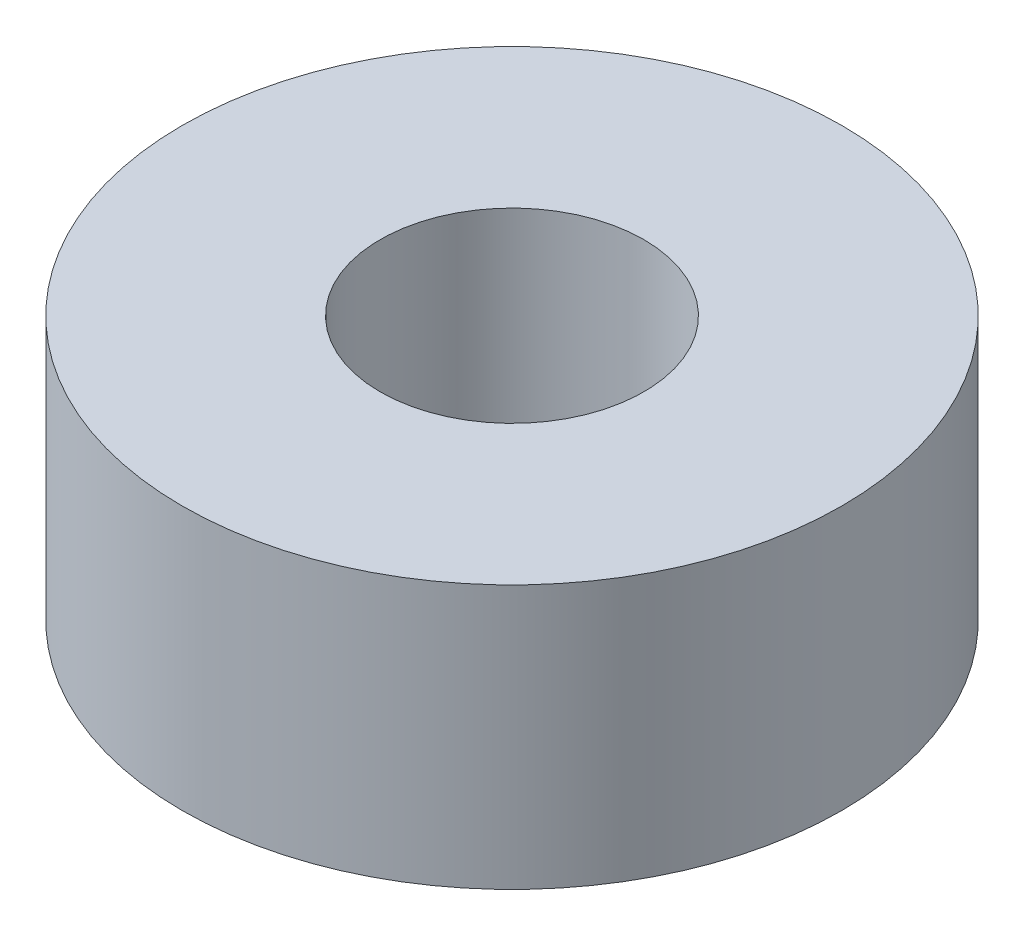
ISO-10303-21;
HEADER;
FILE_DESCRIPTION(('STEP AP214'),'2;1');
FILE_NAME('part.step','',(''),(''),'','','');
FILE_SCHEMA(('AUTOMOTIVE_DESIGN { 1 0 10303 214 1 1 1 1 }'));
ENDSEC;
DATA;
#1=APPLICATION_CONTEXT('core data for automotive mechanical design processes');
#2=APPLICATION_PROTOCOL_DEFINITION('international standard','automotive_design',2000,#1);
#3=PRODUCT_CONTEXT('',#1,'mechanical');
#4=PRODUCT('Part','Part','',(#3));
#5=PRODUCT_RELATED_PRODUCT_CATEGORY('part','',(#4));
#6=PRODUCT_DEFINITION_FORMATION('','',#4);
#7=PRODUCT_DEFINITION_CONTEXT('part definition',#1,'design');
#8=PRODUCT_DEFINITION('design','',#6,#7);
#9=PRODUCT_DEFINITION_SHAPE('','',#8);
#10=(LENGTH_UNIT() NAMED_UNIT(*) SI_UNIT(.MILLI.,.METRE.));
#11=(NAMED_UNIT(*) PLANE_ANGLE_UNIT() SI_UNIT($,.RADIAN.));
#12=(NAMED_UNIT(*) SI_UNIT($,.STERADIAN.) SOLID_ANGLE_UNIT());
#13=UNCERTAINTY_MEASURE_WITH_UNIT(LENGTH_MEASURE(1.E-05),#10,'distance_accuracy_value','');
#14=(GEOMETRIC_REPRESENTATION_CONTEXT(3) GLOBAL_UNCERTAINTY_ASSIGNED_CONTEXT((#13)) GLOBAL_UNIT_ASSIGNED_CONTEXT((#10,
#11,#12)) REPRESENTATION_CONTEXT('',''));
#15=CARTESIAN_POINT('',(0.,0.,0.));
#16=DIRECTION('',(0.,0.,1.));
#17=DIRECTION('',(1.,0.,0.));
#18=AXIS2_PLACEMENT_3D('',#15,#16,#17);
#19=CARTESIAN_POINT('',(0.,10.,0.));
#20=DIRECTION('',(0.,1.,0.));
#21=DIRECTION('',(0.,0.,1.));
#22=AXIS2_PLACEMENT_3D('',#19,#20,#21);
#23=PLANE('',#22);
#24=CARTESIAN_POINT('',(0.,10.,0.));
#25=DIRECTION('',(0.,1.,0.));
#26=DIRECTION('',(0.,0.,1.));
#27=AXIS2_PLACEMENT_3D('',#24,#25,#26);
#28=CIRCLE('',#27,12.5);
#29=CARTESIAN_POINT('',(0.,10.,12.5));
#30=VERTEX_POINT('',#29);
#31=EDGE_CURVE('E10',#30,#30,#28,.T.);
#32=ORIENTED_EDGE('',*,*,#31,.T.);
#33=EDGE_LOOP('',(#32));
#34=FACE_BOUND('',#33,.T.);
#35=CARTESIAN_POINT('',(0.,10.,0.));
#36=DIRECTION('',(0.,1.,0.));
#37=DIRECTION('',(0.,0.,1.));
#38=AXIS2_PLACEMENT_3D('',#35,#36,#37);
#39=CIRCLE('',#38,5.);
#40=CARTESIAN_POINT('',(0.,10.,5.));
#41=VERTEX_POINT('',#40);
#42=EDGE_CURVE('E46',#41,#41,#39,.T.);
#43=ORIENTED_EDGE('',*,*,#42,.F.);
#44=EDGE_LOOP('',(#43));
#45=FACE_BOUND('',#44,.T.);
#46=ADVANCED_FACE('F35',(#34,#45),#23,.T.);
#47=CARTESIAN_POINT('',(0.,0.,0.));
#48=DIRECTION('',(0.,1.,0.));
#49=DIRECTION('',(0.,0.,1.));
#50=AXIS2_PLACEMENT_3D('',#47,#48,#49);
#51=PLANE('',#50);
#52=CARTESIAN_POINT('',(0.,0.,0.));
#53=DIRECTION('',(0.,1.,0.));
#54=DIRECTION('',(0.,0.,1.));
#55=AXIS2_PLACEMENT_3D('',#52,#53,#54);
#56=CIRCLE('',#55,12.5);
#57=CARTESIAN_POINT('',(0.,0.,12.5));
#58=VERTEX_POINT('',#57);
#59=EDGE_CURVE('E39',#58,#58,#56,.T.);
#60=ORIENTED_EDGE('',*,*,#59,.F.);
#61=EDGE_LOOP('',(#60));
#62=FACE_BOUND('',#61,.T.);
#63=CARTESIAN_POINT('',(0.,0.,0.));
#64=DIRECTION('',(0.,1.,0.));
#65=DIRECTION('',(0.,0.,1.));
#66=AXIS2_PLACEMENT_3D('',#63,#64,#65);
#67=CIRCLE('',#66,5.);
#68=CARTESIAN_POINT('',(0.,0.,5.));
#69=VERTEX_POINT('',#68);
#70=EDGE_CURVE('E48',#69,#69,#67,.T.);
#71=ORIENTED_EDGE('',*,*,#70,.T.);
#72=EDGE_LOOP('',(#71));
#73=FACE_BOUND('',#72,.T.);
#74=ADVANCED_FACE('F58',(#62,#73),#51,.F.);
#75=CARTESIAN_POINT('',(0.,10.,0.));
#76=DIRECTION('',(0.,-1.,0.));
#77=DIRECTION('',(0.,0.,-1.));
#78=AXIS2_PLACEMENT_3D('',#75,#76,#77);
#79=CYLINDRICAL_SURFACE('',#78,12.5);
#80=ORIENTED_EDGE('',*,*,#31,.F.);
#81=EDGE_LOOP('',(#80));
#82=FACE_BOUND('',#81,.T.);
#83=ORIENTED_EDGE('',*,*,#59,.T.);
#84=EDGE_LOOP('',(#83));
#85=FACE_BOUND('',#84,.T.);
#86=ADVANCED_FACE('F37',(#82,#85),#79,.T.);
#87=CARTESIAN_POINT('',(0.,10.,0.));
#88=DIRECTION('',(0.,-1.,0.));
#89=DIRECTION('',(0.,0.,-1.));
#90=AXIS2_PLACEMENT_3D('',#87,#88,#89);
#91=CYLINDRICAL_SURFACE('',#90,5.);
#92=ORIENTED_EDGE('',*,*,#42,.T.);
#93=EDGE_LOOP('',(#92));
#94=FACE_BOUND('',#93,.T.);
#95=ORIENTED_EDGE('',*,*,#70,.F.);
#96=EDGE_LOOP('',(#95));
#97=FACE_BOUND('',#96,.T.);
#98=ADVANCED_FACE('F54',(#94,#97),#91,.F.);
#99=CLOSED_SHELL('',(#46,#74,#86,#98));
#100=MANIFOLD_SOLID_BREP('B2',#99);
#101=ADVANCED_BREP_SHAPE_REPRESENTATION('',(#18,#100),#14);
#102=SHAPE_DEFINITION_REPRESENTATION(#9,#101);
ENDSEC;
END-ISO-10303-21;
